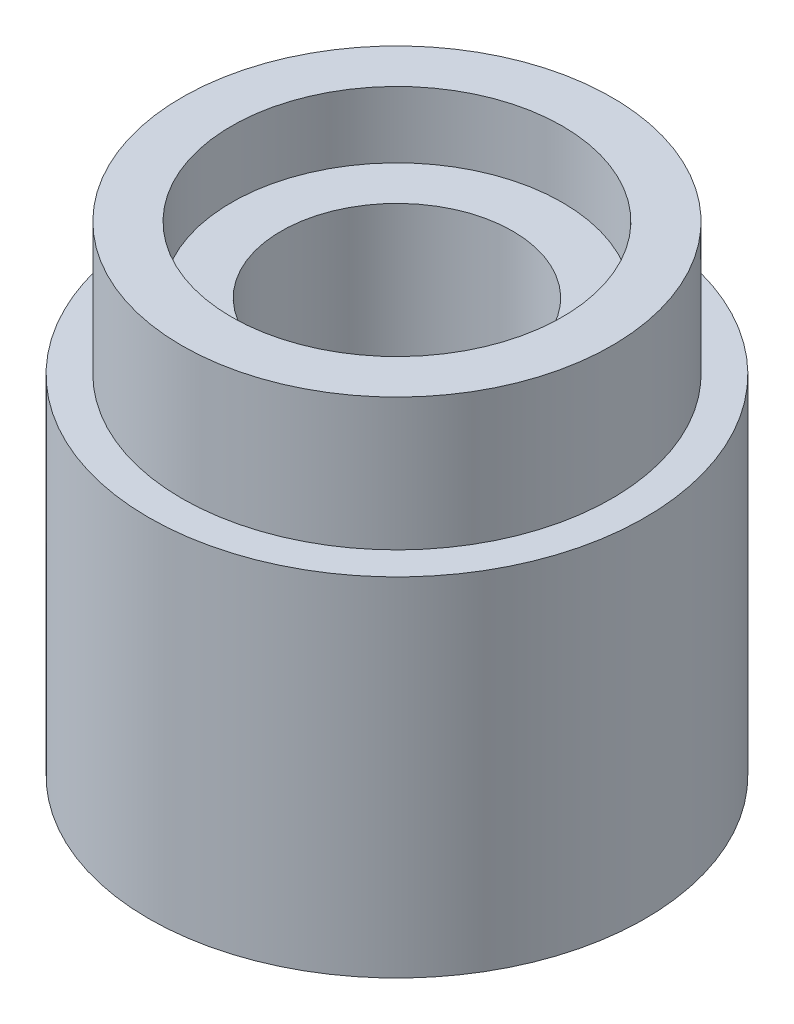
ISO-10303-21;
HEADER;
FILE_DESCRIPTION(('STEP AP214'),'2;1');
FILE_NAME('part.step','',(''),(''),'','','');
FILE_SCHEMA(('AUTOMOTIVE_DESIGN { 1 0 10303 214 1 1 1 1 }'));
ENDSEC;
DATA;
#1=APPLICATION_CONTEXT('core data for automotive mechanical design processes');
#2=APPLICATION_PROTOCOL_DEFINITION('international standard','automotive_design',2000,#1);
#3=PRODUCT_CONTEXT('',#1,'mechanical');
#4=PRODUCT('Part','Part','',(#3));
#5=PRODUCT_RELATED_PRODUCT_CATEGORY('part','',(#4));
#6=PRODUCT_DEFINITION_FORMATION('','',#4);
#7=PRODUCT_DEFINITION_CONTEXT('part definition',#1,'design');
#8=PRODUCT_DEFINITION('design','',#6,#7);
#9=PRODUCT_DEFINITION_SHAPE('','',#8);
#10=(LENGTH_UNIT() NAMED_UNIT(*) SI_UNIT(.MILLI.,.METRE.));
#11=(NAMED_UNIT(*) PLANE_ANGLE_UNIT() SI_UNIT($,.RADIAN.));
#12=(NAMED_UNIT(*) SI_UNIT($,.STERADIAN.) SOLID_ANGLE_UNIT());
#13=UNCERTAINTY_MEASURE_WITH_UNIT(LENGTH_MEASURE(1.E-05),#10,'distance_accuracy_value','');
#14=(GEOMETRIC_REPRESENTATION_CONTEXT(3) GLOBAL_UNCERTAINTY_ASSIGNED_CONTEXT((#13)) GLOBAL_UNIT_ASSIGNED_CONTEXT((#10,
#11,#12)) REPRESENTATION_CONTEXT('',''));
#15=CARTESIAN_POINT('',(0.,0.,0.));
#16=DIRECTION('',(0.,0.,1.));
#17=DIRECTION('',(1.,0.,0.));
#18=AXIS2_PLACEMENT_3D('',#15,#16,#17);
#19=CARTESIAN_POINT('',(0.,7.25,0.));
#20=DIRECTION('',(0.,-1.,0.));
#21=DIRECTION('',(0.,0.,-1.));
#22=AXIS2_PLACEMENT_3D('',#19,#20,#21);
#23=CYLINDRICAL_SURFACE('',#22,3.75);
#24=CARTESIAN_POINT('',(0.,0.,0.));
#25=DIRECTION('',(0.,1.,0.));
#26=DIRECTION('',(0.,0.,1.));
#27=AXIS2_PLACEMENT_3D('',#24,#25,#26);
#28=CIRCLE('',#27,3.75);
#29=CARTESIAN_POINT('',(0.,0.,3.75));
#30=VERTEX_POINT('',#29);
#31=EDGE_CURVE('E10',#30,#30,#28,.T.);
#32=ORIENTED_EDGE('',*,*,#31,.T.);
#33=EDGE_LOOP('',(#32));
#34=FACE_BOUND('',#33,.T.);
#35=CARTESIAN_POINT('',(0.,5.25,0.));
#36=DIRECTION('',(0.,1.,0.));
#37=DIRECTION('',(0.,0.,1.));
#38=AXIS2_PLACEMENT_3D('',#35,#36,#37);
#39=CIRCLE('',#38,3.75);
#40=CARTESIAN_POINT('',(0.,5.25,3.75));
#41=VERTEX_POINT('',#40);
#42=EDGE_CURVE('E44',#41,#41,#39,.T.);
#43=ORIENTED_EDGE('',*,*,#42,.F.);
#44=EDGE_LOOP('',(#43));
#45=FACE_BOUND('',#44,.T.);
#46=ADVANCED_FACE('F36',(#34,#45),#23,.T.);
#47=CARTESIAN_POINT('',(0.,0.,0.));
#48=DIRECTION('',(0.,1.,0.));
#49=DIRECTION('',(0.,0.,1.));
#50=AXIS2_PLACEMENT_3D('',#47,#48,#49);
#51=PLANE('',#50);
#52=ORIENTED_EDGE('',*,*,#31,.F.);
#53=EDGE_LOOP('',(#52));
#54=FACE_BOUND('',#53,.T.);
#55=ADVANCED_FACE('F92',(#54),#51,.F.);
#56=CARTESIAN_POINT('',(0.,5.25,0.));
#57=DIRECTION('',(0.,1.,0.));
#58=DIRECTION('',(0.,0.,1.));
#59=AXIS2_PLACEMENT_3D('',#56,#57,#58);
#60=PLANE('',#59);
#61=CARTESIAN_POINT('',(0.,5.25,0.));
#62=DIRECTION('',(0.,1.,0.));
#63=DIRECTION('',(0.,0.,1.));
#64=AXIS2_PLACEMENT_3D('',#61,#62,#63);
#65=CIRCLE('',#64,3.25);
#66=CARTESIAN_POINT('',(0.,5.25,3.25));
#67=VERTEX_POINT('',#66);
#68=EDGE_CURVE('E49',#67,#67,#65,.T.);
#69=ORIENTED_EDGE('',*,*,#68,.F.);
#70=EDGE_LOOP('',(#69));
#71=FACE_BOUND('',#70,.T.);
#72=ORIENTED_EDGE('',*,*,#42,.T.);
#73=EDGE_LOOP('',(#72));
#74=FACE_BOUND('',#73,.T.);
#75=ADVANCED_FACE('F96',(#71,#74),#60,.T.);
#76=CARTESIAN_POINT('',(0.,5.25,0.));
#77=DIRECTION('',(0.,1.,0.));
#78=DIRECTION('',(0.,0.,1.));
#79=AXIS2_PLACEMENT_3D('',#76,#77,#78);
#80=CYLINDRICAL_SURFACE('',#79,3.25);
#81=ORIENTED_EDGE('',*,*,#68,.T.);
#82=EDGE_LOOP('',(#81));
#83=FACE_BOUND('',#82,.T.);
#84=CARTESIAN_POINT('',(0.,7.25,0.));
#85=DIRECTION('',(0.,1.,0.));
#86=DIRECTION('',(0.,0.,1.));
#87=AXIS2_PLACEMENT_3D('',#84,#85,#86);
#88=CIRCLE('',#87,3.25);
#89=CARTESIAN_POINT('',(0.,7.25,3.25));
#90=VERTEX_POINT('',#89);
#91=EDGE_CURVE('E52',#90,#90,#88,.T.);
#92=ORIENTED_EDGE('',*,*,#91,.F.);
#93=EDGE_LOOP('',(#92));
#94=FACE_BOUND('',#93,.T.);
#95=ADVANCED_FACE('F102',(#83,#94),#80,.T.);
#96=CARTESIAN_POINT('',(0.,7.25,0.));
#97=DIRECTION('',(0.,1.,0.));
#98=DIRECTION('',(0.,0.,1.));
#99=AXIS2_PLACEMENT_3D('',#96,#97,#98);
#100=PLANE('',#99);
#101=CARTESIAN_POINT('',(0.,7.25,0.));
#102=DIRECTION('',(0.,1.,0.));
#103=DIRECTION('',(0.,0.,1.));
#104=AXIS2_PLACEMENT_3D('',#101,#102,#103);
#105=CIRCLE('',#104,2.5);
#106=CARTESIAN_POINT('',(0.,7.25,2.5));
#107=VERTEX_POINT('',#106);
#108=EDGE_CURVE('E63',#107,#107,#105,.T.);
#109=ORIENTED_EDGE('',*,*,#108,.F.);
#110=EDGE_LOOP('',(#109));
#111=FACE_BOUND('',#110,.T.);
#112=ORIENTED_EDGE('',*,*,#91,.T.);
#113=EDGE_LOOP('',(#112));
#114=FACE_BOUND('',#113,.T.);
#115=ADVANCED_FACE('F108',(#111,#114),#100,.T.);
#116=CARTESIAN_POINT('',(0.,6.25,0.));
#117=DIRECTION('',(0.,1.,0.));
#118=DIRECTION('',(0.,0.,1.));
#119=AXIS2_PLACEMENT_3D('',#116,#117,#118);
#120=PLANE('',#119);
#121=CARTESIAN_POINT('',(0.,6.25,0.));
#122=DIRECTION('',(0.,1.,0.));
#123=DIRECTION('',(0.,0.,1.));
#124=AXIS2_PLACEMENT_3D('',#121,#122,#123);
#125=CIRCLE('',#124,2.5);
#126=CARTESIAN_POINT('',(0.,6.25,2.5));
#127=VERTEX_POINT('',#126);
#128=EDGE_CURVE('E67',#127,#127,#125,.T.);
#129=ORIENTED_EDGE('',*,*,#128,.T.);
#130=EDGE_LOOP('',(#129));
#131=FACE_BOUND('',#130,.T.);
#132=CARTESIAN_POINT('',(0.,6.25,0.));
#133=DIRECTION('',(0.,1.,0.));
#134=DIRECTION('',(0.,0.,1.));
#135=AXIS2_PLACEMENT_3D('',#132,#133,#134);
#136=CIRCLE('',#135,1.75);
#137=CARTESIAN_POINT('',(0.,6.25,1.75));
#138=VERTEX_POINT('',#137);
#139=EDGE_CURVE('E39',#138,#138,#136,.F.);
#140=ORIENTED_EDGE('',*,*,#139,.T.);
#141=EDGE_LOOP('',(#140));
#142=FACE_BOUND('',#141,.T.);
#143=ADVANCED_FACE('F76',(#131,#142),#120,.T.);
#144=CARTESIAN_POINT('',(0.,6.25,0.));
#145=DIRECTION('',(0.,1.,0.));
#146=DIRECTION('',(0.,0.,1.));
#147=AXIS2_PLACEMENT_3D('',#144,#145,#146);
#148=CYLINDRICAL_SURFACE('',#147,2.5);
#149=ORIENTED_EDGE('',*,*,#128,.F.);
#150=EDGE_LOOP('',(#149));
#151=FACE_BOUND('',#150,.T.);
#152=ORIENTED_EDGE('',*,*,#108,.T.);
#153=EDGE_LOOP('',(#152));
#154=FACE_BOUND('',#153,.T.);
#155=ADVANCED_FACE('F86',(#151,#154),#148,.F.);
#156=CARTESIAN_POINT('',(0.,0.5,0.));
#157=DIRECTION('',(0.,1.,0.));
#158=DIRECTION('',(0.,0.,1.));
#159=AXIS2_PLACEMENT_3D('',#156,#157,#158);
#160=PLANE('',#159);
#161=CARTESIAN_POINT('',(0.,0.5,0.));
#162=DIRECTION('',(0.,1.,0.));
#163=DIRECTION('',(0.,0.,1.));
#164=AXIS2_PLACEMENT_3D('',#161,#162,#163);
#165=CIRCLE('',#164,1.75);
#166=CARTESIAN_POINT('',(0.,0.5,1.75));
#167=VERTEX_POINT('',#166);
#168=EDGE_CURVE('E56',#167,#167,#165,.T.);
#169=ORIENTED_EDGE('',*,*,#168,.T.);
#170=EDGE_LOOP('',(#169));
#171=FACE_BOUND('',#170,.T.);
#172=ADVANCED_FACE('F80',(#171),#160,.T.);
#173=CARTESIAN_POINT('',(0.,0.5,0.));
#174=DIRECTION('',(0.,1.,0.));
#175=DIRECTION('',(0.,0.,1.));
#176=AXIS2_PLACEMENT_3D('',#173,#174,#175);
#177=CYLINDRICAL_SURFACE('',#176,1.75);
#178=ORIENTED_EDGE('',*,*,#168,.F.);
#179=EDGE_LOOP('',(#178));
#180=FACE_BOUND('',#179,.T.);
#181=ORIENTED_EDGE('',*,*,#139,.F.);
#182=EDGE_LOOP('',(#181));
#183=FACE_BOUND('',#182,.T.);
#184=ADVANCED_FACE('F78',(#180,#183),#177,.F.);
#185=CLOSED_SHELL('',(#46,#55,#75,#95,#115,#143,#155,#172,#184));
#186=MANIFOLD_SOLID_BREP('B2',#185);
#187=ADVANCED_BREP_SHAPE_REPRESENTATION('',(#18,#186),#14);
#188=SHAPE_DEFINITION_REPRESENTATION(#9,#187);
ENDSEC;
END-ISO-10303-21;
